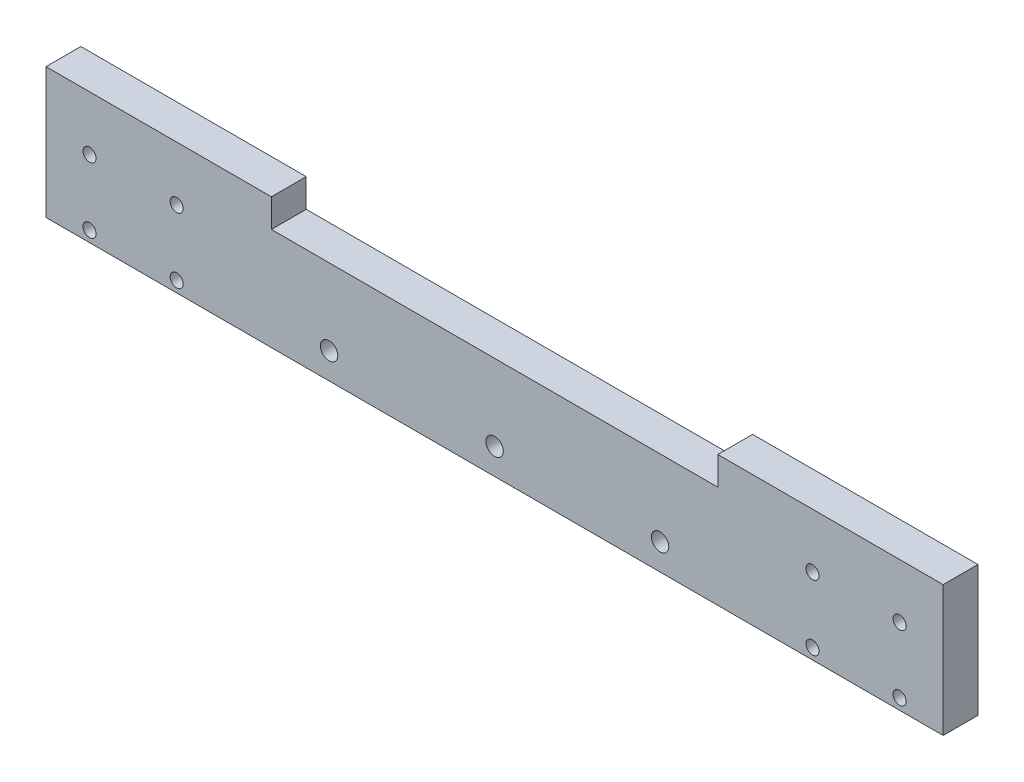
ISO-10303-21;
HEADER;
FILE_DESCRIPTION(('STEP AP214'),'2;1');
FILE_NAME('part.step','',(''),(''),'','','');
FILE_SCHEMA(('AUTOMOTIVE_DESIGN { 1 0 10303 214 1 1 1 1 }'));
ENDSEC;
DATA;
#1=APPLICATION_CONTEXT('core data for automotive mechanical design processes');
#2=APPLICATION_PROTOCOL_DEFINITION('international standard','automotive_design',2000,#1);
#3=PRODUCT_CONTEXT('',#1,'mechanical');
#4=PRODUCT('Part','Part','',(#3));
#5=PRODUCT_RELATED_PRODUCT_CATEGORY('part','',(#4));
#6=PRODUCT_DEFINITION_FORMATION('','',#4);
#7=PRODUCT_DEFINITION_CONTEXT('part definition',#1,'design');
#8=PRODUCT_DEFINITION('design','',#6,#7);
#9=PRODUCT_DEFINITION_SHAPE('','',#8);
#10=(LENGTH_UNIT() NAMED_UNIT(*) SI_UNIT(.MILLI.,.METRE.));
#11=(NAMED_UNIT(*) PLANE_ANGLE_UNIT() SI_UNIT($,.RADIAN.));
#12=(NAMED_UNIT(*) SI_UNIT($,.STERADIAN.) SOLID_ANGLE_UNIT());
#13=UNCERTAINTY_MEASURE_WITH_UNIT(LENGTH_MEASURE(1.E-05),#10,'distance_accuracy_value','');
#14=(GEOMETRIC_REPRESENTATION_CONTEXT(3) GLOBAL_UNCERTAINTY_ASSIGNED_CONTEXT((#13)) GLOBAL_UNIT_ASSIGNED_CONTEXT((#10,
#11,#12)) REPRESENTATION_CONTEXT('',''));
#15=CARTESIAN_POINT('',(0.,0.,0.));
#16=DIRECTION('',(0.,0.,1.));
#17=DIRECTION('',(1.,0.,0.));
#18=AXIS2_PLACEMENT_3D('',#15,#16,#17);
#19=CARTESIAN_POINT('',(0.,30.,8.));
#20=DIRECTION('',(0.,1.,0.));
#21=DIRECTION('',(-1.,0.,0.));
#22=AXIS2_PLACEMENT_3D('',#19,#20,#21);
#23=PLANE('',#22);
#24=DIRECTION('',(1.,0.,0.));
#25=VECTOR('',#24,1.);
#26=CARTESIAN_POINT('',(0.,30.,0.));
#27=LINE('',#26,#25);
#28=CARTESIAN_POINT('',(154.25,30.,0.));
#29=VERTEX_POINT('',#28);
#30=CARTESIAN_POINT('',(206.,30.,0.));
#31=VERTEX_POINT('',#30);
#32=EDGE_CURVE('E133',#29,#31,#27,.T.);
#33=ORIENTED_EDGE('',*,*,#32,.F.);
#34=DIRECTION('',(0.,0.,-1.));
#35=VECTOR('',#34,1.);
#36=CARTESIAN_POINT('',(154.25,30.,8.));
#37=LINE('',#36,#35);
#38=CARTESIAN_POINT('',(154.25,30.,8.));
#39=VERTEX_POINT('',#38);
#40=EDGE_CURVE('E11',#39,#29,#37,.T.);
#41=ORIENTED_EDGE('',*,*,#40,.F.);
#42=DIRECTION('',(1.,0.,0.));
#43=VECTOR('',#42,1.);
#44=CARTESIAN_POINT('',(0.,30.,8.));
#45=LINE('',#44,#43);
#46=CARTESIAN_POINT('',(206.,30.,8.));
#47=VERTEX_POINT('',#46);
#48=EDGE_CURVE('E128',#39,#47,#45,.T.);
#49=ORIENTED_EDGE('',*,*,#48,.T.);
#50=DIRECTION('',(0.,0.,-1.));
#51=VECTOR('',#50,1.);
#52=CARTESIAN_POINT('',(206.,30.,8.));
#53=LINE('',#52,#51);
#54=EDGE_CURVE('E86',#47,#31,#53,.T.);
#55=ORIENTED_EDGE('',*,*,#54,.T.);
#56=EDGE_LOOP('',(#33,#41,#49,#55));
#57=FACE_BOUND('',#56,.T.);
#58=ADVANCED_FACE('F35',(#57),#23,.T.);
#59=CARTESIAN_POINT('',(154.25,0.,8.));
#60=DIRECTION('',(1.,0.,0.));
#61=DIRECTION('',(0.,0.,-1.));
#62=AXIS2_PLACEMENT_3D('',#59,#60,#61);
#63=PLANE('',#62);
#64=DIRECTION('',(0.,-1.,0.));
#65=VECTOR('',#64,1.);
#66=CARTESIAN_POINT('',(154.25,0.,0.));
#67=LINE('',#66,#65);
#68=CARTESIAN_POINT('',(154.25,23.5,0.));
#69=VERTEX_POINT('',#68);
#70=EDGE_CURVE('E136',#29,#69,#67,.T.);
#71=ORIENTED_EDGE('',*,*,#70,.T.);
#72=DIRECTION('',(0.,0.,-1.));
#73=VECTOR('',#72,1.);
#74=CARTESIAN_POINT('',(154.25,23.5,8.));
#75=LINE('',#74,#73);
#76=CARTESIAN_POINT('',(154.25,23.5,8.));
#77=VERTEX_POINT('',#76);
#78=EDGE_CURVE('E44',#77,#69,#75,.T.);
#79=ORIENTED_EDGE('',*,*,#78,.F.);
#80=DIRECTION('',(0.,-1.,0.));
#81=VECTOR('',#80,1.);
#82=CARTESIAN_POINT('',(154.25,0.,8.));
#83=LINE('',#82,#81);
#84=EDGE_CURVE('E174',#39,#77,#83,.T.);
#85=ORIENTED_EDGE('',*,*,#84,.F.);
#86=ORIENTED_EDGE('',*,*,#40,.T.);
#87=EDGE_LOOP('',(#71,#79,#85,#86));
#88=FACE_BOUND('',#87,.T.);
#89=ADVANCED_FACE('F37',(#88),#63,.F.);
#90=CARTESIAN_POINT('',(0.,23.5,8.));
#91=DIRECTION('',(0.,1.,0.));
#92=DIRECTION('',(-1.,0.,0.));
#93=AXIS2_PLACEMENT_3D('',#90,#91,#92);
#94=PLANE('',#93);
#95=DIRECTION('',(1.,0.,0.));
#96=VECTOR('',#95,1.);
#97=CARTESIAN_POINT('',(0.,23.5,0.));
#98=LINE('',#97,#96);
#99=CARTESIAN_POINT('',(51.75,23.5,0.));
#100=VERTEX_POINT('',#99);
#101=EDGE_CURVE('E141',#100,#69,#98,.T.);
#102=ORIENTED_EDGE('',*,*,#101,.F.);
#103=DIRECTION('',(0.,0.,-1.));
#104=VECTOR('',#103,1.);
#105=CARTESIAN_POINT('',(51.75,23.5,8.));
#106=LINE('',#105,#104);
#107=CARTESIAN_POINT('',(51.75,23.5,8.));
#108=VERTEX_POINT('',#107);
#109=EDGE_CURVE('E156',#108,#100,#106,.T.);
#110=ORIENTED_EDGE('',*,*,#109,.F.);
#111=DIRECTION('',(1.,0.,0.));
#112=VECTOR('',#111,1.);
#113=CARTESIAN_POINT('',(0.,23.5,8.));
#114=LINE('',#113,#112);
#115=EDGE_CURVE('E163',#108,#77,#114,.T.);
#116=ORIENTED_EDGE('',*,*,#115,.T.);
#117=ORIENTED_EDGE('',*,*,#78,.T.);
#118=EDGE_LOOP('',(#102,#110,#116,#117));
#119=FACE_BOUND('',#118,.T.);
#120=ADVANCED_FACE('F161',(#119),#94,.T.);
#121=CARTESIAN_POINT('',(51.75,0.,8.));
#122=DIRECTION('',(1.,0.,0.));
#123=DIRECTION('',(0.,0.,-1.));
#124=AXIS2_PLACEMENT_3D('',#121,#122,#123);
#125=PLANE('',#124);
#126=DIRECTION('',(0.,-1.,0.));
#127=VECTOR('',#126,1.);
#128=CARTESIAN_POINT('',(51.75,0.,0.));
#129=LINE('',#128,#127);
#130=CARTESIAN_POINT('',(51.75,30.,0.));
#131=VERTEX_POINT('',#130);
#132=EDGE_CURVE('E144',#131,#100,#129,.T.);
#133=ORIENTED_EDGE('',*,*,#132,.F.);
#134=DIRECTION('',(0.,0.,-1.));
#135=VECTOR('',#134,1.);
#136=CARTESIAN_POINT('',(51.75,30.,8.));
#137=LINE('',#136,#135);
#138=CARTESIAN_POINT('',(51.75,30.,8.));
#139=VERTEX_POINT('',#138);
#140=EDGE_CURVE('E154',#139,#131,#137,.T.);
#141=ORIENTED_EDGE('',*,*,#140,.F.);
#142=DIRECTION('',(0.,-1.,0.));
#143=VECTOR('',#142,1.);
#144=CARTESIAN_POINT('',(51.75,0.,8.));
#145=LINE('',#144,#143);
#146=EDGE_CURVE('E126',#139,#108,#145,.T.);
#147=ORIENTED_EDGE('',*,*,#146,.T.);
#148=ORIENTED_EDGE('',*,*,#109,.T.);
#149=EDGE_LOOP('',(#133,#141,#147,#148));
#150=FACE_BOUND('',#149,.T.);
#151=ADVANCED_FACE('F172',(#150),#125,.T.);
#152=CARTESIAN_POINT('',(0.,30.,0.));
#153=VERTEX_POINT('',#152);
#154=EDGE_CURVE('E138',#153,#131,#27,.T.);
#155=ORIENTED_EDGE('',*,*,#154,.F.);
#156=DIRECTION('',(0.,0.,-1.));
#157=VECTOR('',#156,1.);
#158=CARTESIAN_POINT('',(0.,30.,8.));
#159=LINE('',#158,#157);
#160=CARTESIAN_POINT('',(0.,30.,8.));
#161=VERTEX_POINT('',#160);
#162=EDGE_CURVE('E114',#161,#153,#159,.T.);
#163=ORIENTED_EDGE('',*,*,#162,.F.);
#164=EDGE_CURVE('E124',#161,#139,#45,.T.);
#165=ORIENTED_EDGE('',*,*,#164,.T.);
#166=ORIENTED_EDGE('',*,*,#140,.T.);
#167=EDGE_LOOP('',(#155,#163,#165,#166));
#168=FACE_BOUND('',#167,.T.);
#169=ADVANCED_FACE('F256',(#168),#23,.T.);
#170=CARTESIAN_POINT('',(0.,0.,8.));
#171=DIRECTION('',(-1.,0.,0.));
#172=DIRECTION('',(0.,0.,1.));
#173=AXIS2_PLACEMENT_3D('',#170,#171,#172);
#174=PLANE('',#173);
#175=DIRECTION('',(0.,1.,0.));
#176=VECTOR('',#175,1.);
#177=CARTESIAN_POINT('',(0.,0.,0.));
#178=LINE('',#177,#176);
#179=CARTESIAN_POINT('',(0.,0.,0.));
#180=VERTEX_POINT('',#179);
#181=EDGE_CURVE('E113',#180,#153,#178,.T.);
#182=ORIENTED_EDGE('',*,*,#181,.F.);
#183=DIRECTION('',(0.,0.,-1.));
#184=VECTOR('',#183,1.);
#185=CARTESIAN_POINT('',(0.,0.,8.));
#186=LINE('',#185,#184);
#187=CARTESIAN_POINT('',(0.,0.,8.));
#188=VERTEX_POINT('',#187);
#189=EDGE_CURVE('E107',#188,#180,#186,.T.);
#190=ORIENTED_EDGE('',*,*,#189,.F.);
#191=DIRECTION('',(0.,1.,0.));
#192=VECTOR('',#191,1.);
#193=CARTESIAN_POINT('',(0.,0.,8.));
#194=LINE('',#193,#192);
#195=EDGE_CURVE('E111',#188,#161,#194,.T.);
#196=ORIENTED_EDGE('',*,*,#195,.T.);
#197=ORIENTED_EDGE('',*,*,#162,.T.);
#198=EDGE_LOOP('',(#182,#190,#196,#197));
#199=FACE_BOUND('',#198,.T.);
#200=ADVANCED_FACE('F109',(#199),#174,.T.);
#201=CARTESIAN_POINT('',(0.,0.,8.));
#202=DIRECTION('',(0.,1.,0.));
#203=DIRECTION('',(-1.,0.,0.));
#204=AXIS2_PLACEMENT_3D('',#201,#202,#203);
#205=PLANE('',#204);
#206=DIRECTION('',(1.,0.,0.));
#207=VECTOR('',#206,1.);
#208=CARTESIAN_POINT('',(0.,0.,0.));
#209=LINE('',#208,#207);
#210=CARTESIAN_POINT('',(206.,0.,0.));
#211=VERTEX_POINT('',#210);
#212=EDGE_CURVE('E79',#180,#211,#209,.T.);
#213=ORIENTED_EDGE('',*,*,#212,.T.);
#214=DIRECTION('',(0.,0.,-1.));
#215=VECTOR('',#214,1.);
#216=CARTESIAN_POINT('',(206.,0.,8.));
#217=LINE('',#216,#215);
#218=CARTESIAN_POINT('',(206.,0.,8.));
#219=VERTEX_POINT('',#218);
#220=EDGE_CURVE('E115',#219,#211,#217,.T.);
#221=ORIENTED_EDGE('',*,*,#220,.F.);
#222=DIRECTION('',(1.,0.,0.));
#223=VECTOR('',#222,1.);
#224=CARTESIAN_POINT('',(0.,0.,8.));
#225=LINE('',#224,#223);
#226=EDGE_CURVE('E117',#188,#219,#225,.T.);
#227=ORIENTED_EDGE('',*,*,#226,.F.);
#228=ORIENTED_EDGE('',*,*,#189,.T.);
#229=EDGE_LOOP('',(#213,#221,#227,#228));
#230=FACE_BOUND('',#229,.T.);
#231=ADVANCED_FACE('F118',(#230),#205,.F.);
#232=CARTESIAN_POINT('',(206.,0.,8.));
#233=DIRECTION('',(-1.,0.,0.));
#234=DIRECTION('',(0.,0.,1.));
#235=AXIS2_PLACEMENT_3D('',#232,#233,#234);
#236=PLANE('',#235);
#237=DIRECTION('',(0.,1.,0.));
#238=VECTOR('',#237,1.);
#239=CARTESIAN_POINT('',(206.,0.,0.));
#240=LINE('',#239,#238);
#241=EDGE_CURVE('E149',#211,#31,#240,.T.);
#242=ORIENTED_EDGE('',*,*,#241,.T.);
#243=ORIENTED_EDGE('',*,*,#54,.F.);
#244=DIRECTION('',(0.,1.,0.));
#245=VECTOR('',#244,1.);
#246=CARTESIAN_POINT('',(206.,0.,8.));
#247=LINE('',#246,#245);
#248=EDGE_CURVE('E52',#219,#47,#247,.T.);
#249=ORIENTED_EDGE('',*,*,#248,.F.);
#250=ORIENTED_EDGE('',*,*,#220,.T.);
#251=EDGE_LOOP('',(#242,#243,#249,#250));
#252=FACE_BOUND('',#251,.T.);
#253=ADVANCED_FACE('F270',(#252),#236,.F.);
#254=CARTESIAN_POINT('',(0.,0.,8.));
#255=DIRECTION('',(0.,0.,1.));
#256=DIRECTION('',(1.,0.,0.));
#257=AXIS2_PLACEMENT_3D('',#254,#255,#256);
#258=PLANE('',#257);
#259=CARTESIAN_POINT('',(10.,17.5,8.));
#260=DIRECTION('',(0.,0.,-1.));
#261=DIRECTION('',(-1.,0.,0.));
#262=AXIS2_PLACEMENT_3D('',#259,#260,#261);
#263=CIRCLE('',#262,1.5);
#264=CARTESIAN_POINT('',(8.50000000000001,17.5,8.));
#265=VERTEX_POINT('',#264);
#266=EDGE_CURVE('E237',#265,#265,#263,.T.);
#267=ORIENTED_EDGE('',*,*,#266,.T.);
#268=EDGE_LOOP('',(#267));
#269=FACE_BOUND('',#268,.T.);
#270=CARTESIAN_POINT('',(30.,2.5,8.));
#271=DIRECTION('',(0.,0.,-1.));
#272=DIRECTION('',(-1.,0.,0.));
#273=AXIS2_PLACEMENT_3D('',#270,#271,#272);
#274=CIRCLE('',#273,1.5);
#275=CARTESIAN_POINT('',(28.5,2.5,8.));
#276=VERTEX_POINT('',#275);
#277=EDGE_CURVE('E231',#276,#276,#274,.T.);
#278=ORIENTED_EDGE('',*,*,#277,.T.);
#279=EDGE_LOOP('',(#278));
#280=FACE_BOUND('',#279,.T.);
#281=CARTESIAN_POINT('',(10.,2.5,8.));
#282=DIRECTION('',(0.,0.,-1.));
#283=DIRECTION('',(-1.,0.,0.));
#284=AXIS2_PLACEMENT_3D('',#281,#282,#283);
#285=CIRCLE('',#284,1.5);
#286=CARTESIAN_POINT('',(8.50000000000001,2.5,8.));
#287=VERTEX_POINT('',#286);
#288=EDGE_CURVE('E225',#287,#287,#285,.T.);
#289=ORIENTED_EDGE('',*,*,#288,.T.);
#290=EDGE_LOOP('',(#289));
#291=FACE_BOUND('',#290,.T.);
#292=CARTESIAN_POINT('',(30.,17.5,8.));
#293=DIRECTION('',(0.,0.,-1.));
#294=DIRECTION('',(-1.,0.,0.));
#295=AXIS2_PLACEMENT_3D('',#292,#293,#294);
#296=CIRCLE('',#295,1.5);
#297=CARTESIAN_POINT('',(28.5,17.5,8.));
#298=VERTEX_POINT('',#297);
#299=EDGE_CURVE('E219',#298,#298,#296,.T.);
#300=ORIENTED_EDGE('',*,*,#299,.T.);
#301=EDGE_LOOP('',(#300));
#302=FACE_BOUND('',#301,.T.);
#303=CARTESIAN_POINT('',(196.,17.5,8.));
#304=DIRECTION('',(0.,0.,1.));
#305=DIRECTION('',(1.,0.,0.));
#306=AXIS2_PLACEMENT_3D('',#303,#304,#305);
#307=CIRCLE('',#306,1.5);
#308=CARTESIAN_POINT('',(197.5,17.5,8.));
#309=VERTEX_POINT('',#308);
#310=EDGE_CURVE('E214',#309,#309,#307,.T.);
#311=ORIENTED_EDGE('',*,*,#310,.F.);
#312=EDGE_LOOP('',(#311));
#313=FACE_BOUND('',#312,.T.);
#314=CARTESIAN_POINT('',(176.,2.5,8.));
#315=DIRECTION('',(0.,0.,1.));
#316=DIRECTION('',(1.,0.,0.));
#317=AXIS2_PLACEMENT_3D('',#314,#315,#316);
#318=CIRCLE('',#317,1.5);
#319=CARTESIAN_POINT('',(177.5,2.5,8.));
#320=VERTEX_POINT('',#319);
#321=EDGE_CURVE('E208',#320,#320,#318,.T.);
#322=ORIENTED_EDGE('',*,*,#321,.F.);
#323=EDGE_LOOP('',(#322));
#324=FACE_BOUND('',#323,.T.);
#325=CARTESIAN_POINT('',(196.,2.5,8.));
#326=DIRECTION('',(0.,0.,1.));
#327=DIRECTION('',(1.,0.,0.));
#328=AXIS2_PLACEMENT_3D('',#325,#326,#327);
#329=CIRCLE('',#328,1.5);
#330=CARTESIAN_POINT('',(197.5,2.5,8.));
#331=VERTEX_POINT('',#330);
#332=EDGE_CURVE('E201',#331,#331,#329,.T.);
#333=ORIENTED_EDGE('',*,*,#332,.F.);
#334=EDGE_LOOP('',(#333));
#335=FACE_BOUND('',#334,.T.);
#336=CARTESIAN_POINT('',(176.,17.5,8.));
#337=DIRECTION('',(0.,0.,1.));
#338=DIRECTION('',(1.,0.,0.));
#339=AXIS2_PLACEMENT_3D('',#336,#337,#338);
#340=CIRCLE('',#339,1.5);
#341=CARTESIAN_POINT('',(177.5,17.5,8.));
#342=VERTEX_POINT('',#341);
#343=EDGE_CURVE('E195',#342,#342,#340,.T.);
#344=ORIENTED_EDGE('',*,*,#343,.F.);
#345=EDGE_LOOP('',(#344));
#346=FACE_BOUND('',#345,.T.);
#347=CARTESIAN_POINT('',(141.,6.00000000000005,8.));
#348=DIRECTION('',(0.,0.,1.));
#349=DIRECTION('',(1.,0.,0.));
#350=AXIS2_PLACEMENT_3D('',#347,#348,#349);
#351=CIRCLE('',#350,2.);
#352=CARTESIAN_POINT('',(143.,6.00000000000005,8.));
#353=VERTEX_POINT('',#352);
#354=EDGE_CURVE('E190',#353,#353,#351,.T.);
#355=ORIENTED_EDGE('',*,*,#354,.F.);
#356=EDGE_LOOP('',(#355));
#357=FACE_BOUND('',#356,.T.);
#358=CARTESIAN_POINT('',(65.,6.00000000000003,8.));
#359=DIRECTION('',(0.,0.,1.));
#360=DIRECTION('',(1.,0.,0.));
#361=AXIS2_PLACEMENT_3D('',#358,#359,#360);
#362=CIRCLE('',#361,2.);
#363=CARTESIAN_POINT('',(67.,6.00000000000003,8.));
#364=VERTEX_POINT('',#363);
#365=EDGE_CURVE('E183',#364,#364,#362,.T.);
#366=ORIENTED_EDGE('',*,*,#365,.F.);
#367=EDGE_LOOP('',(#366));
#368=FACE_BOUND('',#367,.T.);
#369=CARTESIAN_POINT('',(103.,6.00000000000003,8.));
#370=DIRECTION('',(0.,0.,1.));
#371=DIRECTION('',(1.,0.,0.));
#372=AXIS2_PLACEMENT_3D('',#369,#370,#371);
#373=CIRCLE('',#372,2.);
#374=CARTESIAN_POINT('',(105.,6.00000000000003,8.));
#375=VERTEX_POINT('',#374);
#376=EDGE_CURVE('E177',#375,#375,#373,.T.);
#377=ORIENTED_EDGE('',*,*,#376,.F.);
#378=EDGE_LOOP('',(#377));
#379=FACE_BOUND('',#378,.T.);
#380=ORIENTED_EDGE('',*,*,#48,.F.);
#381=ORIENTED_EDGE('',*,*,#84,.T.);
#382=ORIENTED_EDGE('',*,*,#115,.F.);
#383=ORIENTED_EDGE('',*,*,#146,.F.);
#384=ORIENTED_EDGE('',*,*,#164,.F.);
#385=ORIENTED_EDGE('',*,*,#195,.F.);
#386=ORIENTED_EDGE('',*,*,#226,.T.);
#387=ORIENTED_EDGE('',*,*,#248,.T.);
#388=EDGE_LOOP('',(#380,#381,#382,#383,#384,#385,#386,#387));
#389=FACE_BOUND('',#388,.T.);
#390=ADVANCED_FACE('F121',(#269,#280,#291,#302,#313,#324,#335,#346,#357,#368,#379,#389),#258,.T.);
#391=CARTESIAN_POINT('',(0.,0.,0.));
#392=DIRECTION('',(0.,0.,1.));
#393=DIRECTION('',(1.,0.,0.));
#394=AXIS2_PLACEMENT_3D('',#391,#392,#393);
#395=PLANE('',#394);
#396=CARTESIAN_POINT('',(141.,6.00000000000005,0.));
#397=DIRECTION('',(0.,0.,1.));
#398=DIRECTION('',(1.,0.,0.));
#399=AXIS2_PLACEMENT_3D('',#396,#397,#398);
#400=CIRCLE('',#399,2.);
#401=CARTESIAN_POINT('',(143.,6.00000000000005,0.));
#402=VERTEX_POINT('',#401);
#403=EDGE_CURVE('E180',#402,#402,#400,.T.);
#404=ORIENTED_EDGE('',*,*,#403,.T.);
#405=EDGE_LOOP('',(#404));
#406=FACE_BOUND('',#405,.T.);
#407=CARTESIAN_POINT('',(65.,6.00000000000003,0.));
#408=DIRECTION('',(0.,0.,1.));
#409=DIRECTION('',(1.,0.,0.));
#410=AXIS2_PLACEMENT_3D('',#407,#408,#409);
#411=CIRCLE('',#410,2.);
#412=CARTESIAN_POINT('',(67.,6.00000000000003,0.));
#413=VERTEX_POINT('',#412);
#414=EDGE_CURVE('E186',#413,#413,#411,.T.);
#415=ORIENTED_EDGE('',*,*,#414,.T.);
#416=EDGE_LOOP('',(#415));
#417=FACE_BOUND('',#416,.T.);
#418=CARTESIAN_POINT('',(103.,6.00000000000003,0.));
#419=DIRECTION('',(0.,0.,1.));
#420=DIRECTION('',(1.,0.,0.));
#421=AXIS2_PLACEMENT_3D('',#418,#419,#420);
#422=CIRCLE('',#421,2.);
#423=CARTESIAN_POINT('',(105.,6.00000000000003,0.));
#424=VERTEX_POINT('',#423);
#425=EDGE_CURVE('E137',#424,#424,#422,.T.);
#426=ORIENTED_EDGE('',*,*,#425,.T.);
#427=EDGE_LOOP('',(#426));
#428=FACE_BOUND('',#427,.T.);
#429=ORIENTED_EDGE('',*,*,#32,.T.);
#430=ORIENTED_EDGE('',*,*,#241,.F.);
#431=ORIENTED_EDGE('',*,*,#212,.F.);
#432=ORIENTED_EDGE('',*,*,#181,.T.);
#433=ORIENTED_EDGE('',*,*,#154,.T.);
#434=ORIENTED_EDGE('',*,*,#132,.T.);
#435=ORIENTED_EDGE('',*,*,#101,.T.);
#436=ORIENTED_EDGE('',*,*,#70,.F.);
#437=EDGE_LOOP('',(#429,#430,#431,#432,#433,#434,#435,#436));
#438=FACE_BOUND('',#437,.T.);
#439=ADVANCED_FACE('F167',(#406,#417,#428,#438),#395,.F.);
#440=CARTESIAN_POINT('',(103.,6.00000000000003,0.));
#441=DIRECTION('',(0.,0.,1.));
#442=DIRECTION('',(1.,0.,0.));
#443=AXIS2_PLACEMENT_3D('',#440,#441,#442);
#444=CYLINDRICAL_SURFACE('',#443,2.);
#445=ORIENTED_EDGE('',*,*,#425,.F.);
#446=EDGE_LOOP('',(#445));
#447=FACE_BOUND('',#446,.T.);
#448=ORIENTED_EDGE('',*,*,#376,.T.);
#449=EDGE_LOOP('',(#448));
#450=FACE_BOUND('',#449,.T.);
#451=ADVANCED_FACE('F283',(#447,#450),#444,.F.);
#452=CARTESIAN_POINT('',(65.,6.00000000000003,0.));
#453=DIRECTION('',(0.,0.,1.));
#454=DIRECTION('',(1.,0.,0.));
#455=AXIS2_PLACEMENT_3D('',#452,#453,#454);
#456=CYLINDRICAL_SURFACE('',#455,2.);
#457=ORIENTED_EDGE('',*,*,#414,.F.);
#458=EDGE_LOOP('',(#457));
#459=FACE_BOUND('',#458,.T.);
#460=ORIENTED_EDGE('',*,*,#365,.T.);
#461=EDGE_LOOP('',(#460));
#462=FACE_BOUND('',#461,.T.);
#463=ADVANCED_FACE('F288',(#459,#462),#456,.F.);
#464=CARTESIAN_POINT('',(141.,6.00000000000005,0.));
#465=DIRECTION('',(0.,0.,1.));
#466=DIRECTION('',(1.,0.,0.));
#467=AXIS2_PLACEMENT_3D('',#464,#465,#466);
#468=CYLINDRICAL_SURFACE('',#467,2.);
#469=ORIENTED_EDGE('',*,*,#403,.F.);
#470=EDGE_LOOP('',(#469));
#471=FACE_BOUND('',#470,.T.);
#472=ORIENTED_EDGE('',*,*,#354,.T.);
#473=EDGE_LOOP('',(#472));
#474=FACE_BOUND('',#473,.T.);
#475=ADVANCED_FACE('F292',(#471,#474),#468,.F.);
#476=CARTESIAN_POINT('',(176.,17.5,3.));
#477=DIRECTION('',(0.,0.,1.));
#478=DIRECTION('',(1.,0.,0.));
#479=AXIS2_PLACEMENT_3D('',#476,#477,#478);
#480=CYLINDRICAL_SURFACE('',#479,1.5);
#481=CARTESIAN_POINT('',(176.,17.5,3.));
#482=DIRECTION('',(0.,0.,1.));
#483=DIRECTION('',(1.,0.,0.));
#484=AXIS2_PLACEMENT_3D('',#481,#482,#483);
#485=CIRCLE('',#484,1.5);
#486=CARTESIAN_POINT('',(177.5,17.5,3.));
#487=VERTEX_POINT('',#486);
#488=EDGE_CURVE('E187',#487,#487,#485,.T.);
#489=ORIENTED_EDGE('',*,*,#488,.F.);
#490=EDGE_LOOP('',(#489));
#491=FACE_BOUND('',#490,.T.);
#492=ORIENTED_EDGE('',*,*,#343,.T.);
#493=EDGE_LOOP('',(#492));
#494=FACE_BOUND('',#493,.T.);
#495=ADVANCED_FACE('F296',(#491,#494),#480,.F.);
#496=CARTESIAN_POINT('',(176.,17.5,3.));
#497=DIRECTION('',(0.,0.,1.));
#498=DIRECTION('',(1.,0.,0.));
#499=AXIS2_PLACEMENT_3D('',#496,#497,#498);
#500=PLANE('',#499);
#501=ORIENTED_EDGE('',*,*,#488,.T.);
#502=EDGE_LOOP('',(#501));
#503=FACE_BOUND('',#502,.T.);
#504=ADVANCED_FACE('F300',(#503),#500,.T.);
#505=CARTESIAN_POINT('',(196.,2.5,3.));
#506=DIRECTION('',(0.,0.,1.));
#507=DIRECTION('',(1.,0.,0.));
#508=AXIS2_PLACEMENT_3D('',#505,#506,#507);
#509=CYLINDRICAL_SURFACE('',#508,1.5);
#510=CARTESIAN_POINT('',(196.,2.5,3.));
#511=DIRECTION('',(0.,0.,1.));
#512=DIRECTION('',(1.,0.,0.));
#513=AXIS2_PLACEMENT_3D('',#510,#511,#512);
#514=CIRCLE('',#513,1.5);
#515=CARTESIAN_POINT('',(197.5,2.5,3.));
#516=VERTEX_POINT('',#515);
#517=EDGE_CURVE('E204',#516,#516,#514,.T.);
#518=ORIENTED_EDGE('',*,*,#517,.F.);
#519=EDGE_LOOP('',(#518));
#520=FACE_BOUND('',#519,.T.);
#521=ORIENTED_EDGE('',*,*,#332,.T.);
#522=EDGE_LOOP('',(#521));
#523=FACE_BOUND('',#522,.T.);
#524=ADVANCED_FACE('F304',(#520,#523),#509,.F.);
#525=CARTESIAN_POINT('',(196.,2.5,3.));
#526=DIRECTION('',(0.,0.,1.));
#527=DIRECTION('',(1.,0.,0.));
#528=AXIS2_PLACEMENT_3D('',#525,#526,#527);
#529=PLANE('',#528);
#530=ORIENTED_EDGE('',*,*,#517,.T.);
#531=EDGE_LOOP('',(#530));
#532=FACE_BOUND('',#531,.T.);
#533=ADVANCED_FACE('F308',(#532),#529,.T.);
#534=CARTESIAN_POINT('',(176.,2.5,3.));
#535=DIRECTION('',(0.,0.,1.));
#536=DIRECTION('',(1.,0.,0.));
#537=AXIS2_PLACEMENT_3D('',#534,#535,#536);
#538=CYLINDRICAL_SURFACE('',#537,1.5);
#539=CARTESIAN_POINT('',(176.,2.5,3.));
#540=DIRECTION('',(0.,0.,1.));
#541=DIRECTION('',(1.,0.,0.));
#542=AXIS2_PLACEMENT_3D('',#539,#540,#541);
#543=CIRCLE('',#542,1.5);
#544=CARTESIAN_POINT('',(177.5,2.5,3.));
#545=VERTEX_POINT('',#544);
#546=EDGE_CURVE('E211',#545,#545,#543,.T.);
#547=ORIENTED_EDGE('',*,*,#546,.F.);
#548=EDGE_LOOP('',(#547));
#549=FACE_BOUND('',#548,.T.);
#550=ORIENTED_EDGE('',*,*,#321,.T.);
#551=EDGE_LOOP('',(#550));
#552=FACE_BOUND('',#551,.T.);
#553=ADVANCED_FACE('F312',(#549,#552),#538,.F.);
#554=CARTESIAN_POINT('',(176.,2.5,3.));
#555=DIRECTION('',(0.,0.,1.));
#556=DIRECTION('',(1.,0.,0.));
#557=AXIS2_PLACEMENT_3D('',#554,#555,#556);
#558=PLANE('',#557);
#559=ORIENTED_EDGE('',*,*,#546,.T.);
#560=EDGE_LOOP('',(#559));
#561=FACE_BOUND('',#560,.T.);
#562=ADVANCED_FACE('F316',(#561),#558,.T.);
#563=CARTESIAN_POINT('',(196.,17.5,3.));
#564=DIRECTION('',(0.,0.,1.));
#565=DIRECTION('',(1.,0.,0.));
#566=AXIS2_PLACEMENT_3D('',#563,#564,#565);
#567=CYLINDRICAL_SURFACE('',#566,1.5);
#568=CARTESIAN_POINT('',(196.,17.5,3.));
#569=DIRECTION('',(0.,0.,1.));
#570=DIRECTION('',(1.,0.,0.));
#571=AXIS2_PLACEMENT_3D('',#568,#569,#570);
#572=CIRCLE('',#571,1.5);
#573=CARTESIAN_POINT('',(197.5,17.5,3.));
#574=VERTEX_POINT('',#573);
#575=EDGE_CURVE('E198',#574,#574,#572,.T.);
#576=ORIENTED_EDGE('',*,*,#575,.F.);
#577=EDGE_LOOP('',(#576));
#578=FACE_BOUND('',#577,.T.);
#579=ORIENTED_EDGE('',*,*,#310,.T.);
#580=EDGE_LOOP('',(#579));
#581=FACE_BOUND('',#580,.T.);
#582=ADVANCED_FACE('F320',(#578,#581),#567,.F.);
#583=CARTESIAN_POINT('',(196.,17.5,3.));
#584=DIRECTION('',(0.,0.,1.));
#585=DIRECTION('',(1.,0.,0.));
#586=AXIS2_PLACEMENT_3D('',#583,#584,#585);
#587=PLANE('',#586);
#588=ORIENTED_EDGE('',*,*,#575,.T.);
#589=EDGE_LOOP('',(#588));
#590=FACE_BOUND('',#589,.T.);
#591=ADVANCED_FACE('F324',(#590),#587,.T.);
#592=CARTESIAN_POINT('',(30.,17.5,3.));
#593=DIRECTION('',(0.,0.,1.));
#594=DIRECTION('',(1.,0.,0.));
#595=AXIS2_PLACEMENT_3D('',#592,#593,#594);
#596=CYLINDRICAL_SURFACE('',#595,1.5);
#597=CARTESIAN_POINT('',(30.,17.5,3.));
#598=DIRECTION('',(0.,0.,-1.));
#599=DIRECTION('',(-1.,0.,0.));
#600=AXIS2_PLACEMENT_3D('',#597,#598,#599);
#601=CIRCLE('',#600,1.5);
#602=CARTESIAN_POINT('',(28.5,17.5,3.));
#603=VERTEX_POINT('',#602);
#604=EDGE_CURVE('E205',#603,#603,#601,.T.);
#605=ORIENTED_EDGE('',*,*,#604,.T.);
#606=EDGE_LOOP('',(#605));
#607=FACE_BOUND('',#606,.T.);
#608=ORIENTED_EDGE('',*,*,#299,.F.);
#609=EDGE_LOOP('',(#608));
#610=FACE_BOUND('',#609,.T.);
#611=ADVANCED_FACE('F328',(#607,#610),#596,.F.);
#612=CARTESIAN_POINT('',(30.,17.5,3.));
#613=DIRECTION('',(0.,0.,1.));
#614=DIRECTION('',(-1.,0.,0.));
#615=AXIS2_PLACEMENT_3D('',#612,#613,#614);
#616=PLANE('',#615);
#617=ORIENTED_EDGE('',*,*,#604,.F.);
#618=EDGE_LOOP('',(#617));
#619=FACE_BOUND('',#618,.T.);
#620=ADVANCED_FACE('F332',(#619),#616,.T.);
#621=CARTESIAN_POINT('',(10.,2.5,3.));
#622=DIRECTION('',(0.,0.,1.));
#623=DIRECTION('',(1.,0.,0.));
#624=AXIS2_PLACEMENT_3D('',#621,#622,#623);
#625=CYLINDRICAL_SURFACE('',#624,1.5);
#626=CARTESIAN_POINT('',(10.,2.5,3.));
#627=DIRECTION('',(0.,0.,-1.));
#628=DIRECTION('',(-1.,0.,0.));
#629=AXIS2_PLACEMENT_3D('',#626,#627,#628);
#630=CIRCLE('',#629,1.5);
#631=CARTESIAN_POINT('',(8.50000000000001,2.5,3.));
#632=VERTEX_POINT('',#631);
#633=EDGE_CURVE('E228',#632,#632,#630,.T.);
#634=ORIENTED_EDGE('',*,*,#633,.T.);
#635=EDGE_LOOP('',(#634));
#636=FACE_BOUND('',#635,.T.);
#637=ORIENTED_EDGE('',*,*,#288,.F.);
#638=EDGE_LOOP('',(#637));
#639=FACE_BOUND('',#638,.T.);
#640=ADVANCED_FACE('F336',(#636,#639),#625,.F.);
#641=CARTESIAN_POINT('',(10.,2.5,3.));
#642=DIRECTION('',(0.,0.,1.));
#643=DIRECTION('',(-1.,0.,0.));
#644=AXIS2_PLACEMENT_3D('',#641,#642,#643);
#645=PLANE('',#644);
#646=ORIENTED_EDGE('',*,*,#633,.F.);
#647=EDGE_LOOP('',(#646));
#648=FACE_BOUND('',#647,.T.);
#649=ADVANCED_FACE('F340',(#648),#645,.T.);
#650=CARTESIAN_POINT('',(30.,2.5,3.));
#651=DIRECTION('',(0.,0.,1.));
#652=DIRECTION('',(1.,0.,0.));
#653=AXIS2_PLACEMENT_3D('',#650,#651,#652);
#654=CYLINDRICAL_SURFACE('',#653,1.5);
#655=CARTESIAN_POINT('',(30.,2.5,3.));
#656=DIRECTION('',(0.,0.,-1.));
#657=DIRECTION('',(-1.,0.,0.));
#658=AXIS2_PLACEMENT_3D('',#655,#656,#657);
#659=CIRCLE('',#658,1.5);
#660=CARTESIAN_POINT('',(28.5,2.5,3.));
#661=VERTEX_POINT('',#660);
#662=EDGE_CURVE('E234',#661,#661,#659,.T.);
#663=ORIENTED_EDGE('',*,*,#662,.T.);
#664=EDGE_LOOP('',(#663));
#665=FACE_BOUND('',#664,.T.);
#666=ORIENTED_EDGE('',*,*,#277,.F.);
#667=EDGE_LOOP('',(#666));
#668=FACE_BOUND('',#667,.T.);
#669=ADVANCED_FACE('F344',(#665,#668),#654,.F.);
#670=CARTESIAN_POINT('',(30.,2.5,3.));
#671=DIRECTION('',(0.,0.,1.));
#672=DIRECTION('',(-1.,0.,0.));
#673=AXIS2_PLACEMENT_3D('',#670,#671,#672);
#674=PLANE('',#673);
#675=ORIENTED_EDGE('',*,*,#662,.F.);
#676=EDGE_LOOP('',(#675));
#677=FACE_BOUND('',#676,.T.);
#678=ADVANCED_FACE('F252',(#677),#674,.T.);
#679=CARTESIAN_POINT('',(10.,17.5,3.));
#680=DIRECTION('',(0.,0.,1.));
#681=DIRECTION('',(1.,0.,0.));
#682=AXIS2_PLACEMENT_3D('',#679,#680,#681);
#683=CYLINDRICAL_SURFACE('',#682,1.5);
#684=CARTESIAN_POINT('',(10.,17.5,3.));
#685=DIRECTION('',(0.,0.,-1.));
#686=DIRECTION('',(-1.,0.,0.));
#687=AXIS2_PLACEMENT_3D('',#684,#685,#686);
#688=CIRCLE('',#687,1.5);
#689=CARTESIAN_POINT('',(8.50000000000001,17.5,3.));
#690=VERTEX_POINT('',#689);
#691=EDGE_CURVE('E222',#690,#690,#688,.T.);
#692=ORIENTED_EDGE('',*,*,#691,.T.);
#693=EDGE_LOOP('',(#692));
#694=FACE_BOUND('',#693,.T.);
#695=ORIENTED_EDGE('',*,*,#266,.F.);
#696=EDGE_LOOP('',(#695));
#697=FACE_BOUND('',#696,.T.);
#698=ADVANCED_FACE('F243',(#694,#697),#683,.F.);
#699=CARTESIAN_POINT('',(10.,17.5,3.));
#700=DIRECTION('',(0.,0.,1.));
#701=DIRECTION('',(-1.,0.,0.));
#702=AXIS2_PLACEMENT_3D('',#699,#700,#701);
#703=PLANE('',#702);
#704=ORIENTED_EDGE('',*,*,#691,.F.);
#705=EDGE_LOOP('',(#704));
#706=FACE_BOUND('',#705,.T.);
#707=ADVANCED_FACE('F246',(#706),#703,.T.);
#708=CLOSED_SHELL('',(#58,#89,#120,#151,#169,#200,#231,#253,#390,#439,#451,#463,#475,#495,#504,
#524,#533,#553,#562,#582,#591,#611,#620,#640,#649,#669,#678,#698,#707));
#709=MANIFOLD_SOLID_BREP('B2',#708);
#710=ADVANCED_BREP_SHAPE_REPRESENTATION('',(#18,#709),#14);
#711=SHAPE_DEFINITION_REPRESENTATION(#9,#710);
ENDSEC;
END-ISO-10303-21;
